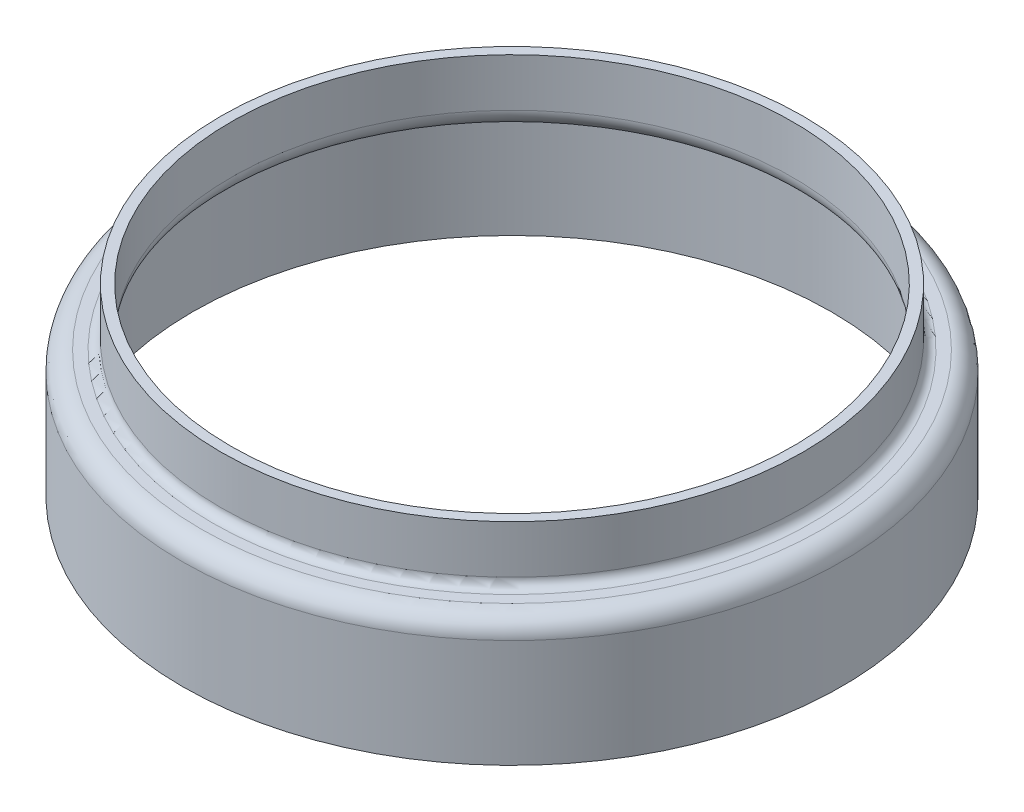
ISO-10303-21;
HEADER;
FILE_DESCRIPTION(('STEP AP214'),'2;1');
FILE_NAME('part.step','',(''),(''),'','','');
FILE_SCHEMA(('AUTOMOTIVE_DESIGN { 1 0 10303 214 1 1 1 1 }'));
ENDSEC;
DATA;
#1=APPLICATION_CONTEXT('core data for automotive mechanical design processes');
#2=APPLICATION_PROTOCOL_DEFINITION('international standard','automotive_design',2000,#1);
#3=PRODUCT_CONTEXT('',#1,'mechanical');
#4=PRODUCT('Part','Part','',(#3));
#5=PRODUCT_RELATED_PRODUCT_CATEGORY('part','',(#4));
#6=PRODUCT_DEFINITION_FORMATION('','',#4);
#7=PRODUCT_DEFINITION_CONTEXT('part definition',#1,'design');
#8=PRODUCT_DEFINITION('design','',#6,#7);
#9=PRODUCT_DEFINITION_SHAPE('','',#8);
#10=(LENGTH_UNIT() NAMED_UNIT(*) SI_UNIT(.MILLI.,.METRE.));
#11=(NAMED_UNIT(*) PLANE_ANGLE_UNIT() SI_UNIT($,.RADIAN.));
#12=(NAMED_UNIT(*) SI_UNIT($,.STERADIAN.) SOLID_ANGLE_UNIT());
#13=UNCERTAINTY_MEASURE_WITH_UNIT(LENGTH_MEASURE(1.E-05),#10,'distance_accuracy_value','');
#14=(GEOMETRIC_REPRESENTATION_CONTEXT(3) GLOBAL_UNCERTAINTY_ASSIGNED_CONTEXT((#13)) GLOBAL_UNIT_ASSIGNED_CONTEXT((#10,
#11,#12)) REPRESENTATION_CONTEXT('',''));
#15=CARTESIAN_POINT('',(0.,0.,0.));
#16=DIRECTION('',(0.,0.,1.));
#17=DIRECTION('',(1.,0.,0.));
#18=AXIS2_PLACEMENT_3D('',#15,#16,#17);
#19=CARTESIAN_POINT('',(0.,71.5790860873113,0.));
#20=DIRECTION('',(0.,1.,0.));
#21=DIRECTION('',(0.,0.,1.));
#22=AXIS2_PLACEMENT_3D('',#19,#20,#21);
#23=CYLINDRICAL_SURFACE('',#22,8.15339999999999);
#24=CARTESIAN_POINT('',(0.,4.57199999999999,0.));
#25=DIRECTION('',(0.,1.,0.));
#26=DIRECTION('',(0.,0.,1.));
#27=AXIS2_PLACEMENT_3D('',#24,#25,#26);
#28=CIRCLE('',#27,8.15339999999999);
#29=CARTESIAN_POINT('',(0.,4.57199999999999,8.15339999999999));
#30=VERTEX_POINT('',#29);
#31=EDGE_CURVE('E249',#30,#30,#28,.T.);
#32=ORIENTED_EDGE('',*,*,#31,.F.);
#33=EDGE_LOOP('',(#32));
#34=FACE_BOUND('',#33,.T.);
#35=CARTESIAN_POINT('',(0.,5.969,0.));
#36=DIRECTION('',(0.,1.,0.));
#37=DIRECTION('',(0.,0.,1.));
#38=AXIS2_PLACEMENT_3D('',#35,#36,#37);
#39=CIRCLE('',#38,8.15339999999999);
#40=CARTESIAN_POINT('',(0.,5.969,8.15339999999999));
#41=VERTEX_POINT('',#40);
#42=EDGE_CURVE('E64',#41,#41,#39,.T.);
#43=ORIENTED_EDGE('',*,*,#42,.T.);
#44=EDGE_LOOP('',(#43));
#45=FACE_BOUND('',#44,.T.);
#46=ADVANCED_FACE('F17',(#34,#45),#23,.F.);
#47=CARTESIAN_POINT('',(0.,4.572,0.));
#48=DIRECTION('',(0.,1.,0.));
#49=DIRECTION('',(0.,0.,1.));
#50=AXIS2_PLACEMENT_3D('',#47,#48,#49);
#51=TOROIDAL_SURFACE('',#50,8.69949999999999,0.5461);
#52=CARTESIAN_POINT('',(0.,4.0259,0.));
#53=DIRECTION('',(0.,-1.,0.));
#54=DIRECTION('',(0.,0.,1.));
#55=AXIS2_PLACEMENT_3D('',#52,#53,#54);
#56=CIRCLE('',#55,8.69949999999999);
#57=CARTESIAN_POINT('',(0.,4.0259,8.69949999999999));
#58=VERTEX_POINT('',#57);
#59=CARTESIAN_POINT('',(0.,4.0259,-8.69949999999999));
#60=VERTEX_POINT('',#59);
#61=EDGE_CURVE('E59',#58,#60,#56,.T.);
#62=ORIENTED_EDGE('',*,*,#61,.T.);
#63=CARTESIAN_POINT('',(0.,4.0259,0.));
#64=DIRECTION('',(0.,-1.,0.));
#65=DIRECTION('',(0.,0.,-1.));
#66=AXIS2_PLACEMENT_3D('',#63,#64,#65);
#67=CIRCLE('',#66,8.69949999999999);
#68=EDGE_CURVE('E56',#60,#58,#67,.T.);
#69=ORIENTED_EDGE('',*,*,#68,.T.);
#70=EDGE_LOOP('',(#62,#69));
#71=FACE_BOUND('',#70,.T.);
#72=ORIENTED_EDGE('',*,*,#31,.T.);
#73=EDGE_LOOP('',(#72));
#74=FACE_BOUND('',#73,.T.);
#75=ADVANCED_FACE('F60',(#71,#74),#51,.T.);
#76=CARTESIAN_POINT('',(0.,5.969,8.44549999999999));
#77=DIRECTION('',(0.,-1.,0.));
#78=DIRECTION('',(0.,0.,-1.));
#79=AXIS2_PLACEMENT_3D('',#76,#77,#78);
#80=PLANE('',#79);
#81=CARTESIAN_POINT('',(0.,5.969,0.));
#82=DIRECTION('',(0.,1.,0.));
#83=DIRECTION('',(0.,0.,1.));
#84=AXIS2_PLACEMENT_3D('',#81,#82,#83);
#85=CIRCLE('',#84,8.44549999999999);
#86=CARTESIAN_POINT('',(0.,5.969,8.44549999999999));
#87=VERTEX_POINT('',#86);
#88=EDGE_CURVE('E69',#87,#87,#85,.F.);
#89=ORIENTED_EDGE('',*,*,#88,.F.);
#90=EDGE_LOOP('',(#89));
#91=FACE_BOUND('',#90,.T.);
#92=ORIENTED_EDGE('',*,*,#42,.F.);
#93=EDGE_LOOP('',(#92));
#94=FACE_BOUND('',#93,.T.);
#95=ADVANCED_FACE('F90',(#91,#94),#80,.F.);
#96=CARTESIAN_POINT('',(0.,4.0259,8.69949999999999));
#97=DIRECTION('',(0.,1.,0.));
#98=DIRECTION('',(0.,0.,1.));
#99=AXIS2_PLACEMENT_3D('',#96,#97,#98);
#100=PLANE('',#99);
#101=ORIENTED_EDGE('',*,*,#61,.F.);
#102=ORIENTED_EDGE('',*,*,#68,.F.);
#103=EDGE_LOOP('',(#101,#102));
#104=FACE_BOUND('',#103,.T.);
#105=CARTESIAN_POINT('',(0.,4.0259,0.));
#106=DIRECTION('',(0.,1.,0.));
#107=DIRECTION('',(0.,0.,-1.));
#108=AXIS2_PLACEMENT_3D('',#105,#106,#107);
#109=CIRCLE('',#108,9.01699999999999);
#110=CARTESIAN_POINT('',(0.,4.0259,9.01699999999999));
#111=VERTEX_POINT('',#110);
#112=CARTESIAN_POINT('',(0.,4.0259,-9.01699999999999));
#113=VERTEX_POINT('',#112);
#114=EDGE_CURVE('E110',#111,#113,#109,.F.);
#115=ORIENTED_EDGE('',*,*,#114,.T.);
#116=CARTESIAN_POINT('',(0.,4.0259,0.));
#117=DIRECTION('',(0.,1.,0.));
#118=DIRECTION('',(0.,0.,1.));
#119=AXIS2_PLACEMENT_3D('',#116,#117,#118);
#120=CIRCLE('',#119,9.01699999999999);
#121=EDGE_CURVE('E109',#113,#111,#120,.F.);
#122=ORIENTED_EDGE('',*,*,#121,.T.);
#123=EDGE_LOOP('',(#115,#122));
#124=FACE_BOUND('',#123,.T.);
#125=ADVANCED_FACE('F67',(#104,#124),#100,.F.);
#126=CARTESIAN_POINT('',(0.,71.5790860873113,0.));
#127=DIRECTION('',(0.,1.,0.));
#128=DIRECTION('',(0.,0.,1.));
#129=AXIS2_PLACEMENT_3D('',#126,#127,#128);
#130=CYLINDRICAL_SURFACE('',#129,8.44549999999999);
#131=CARTESIAN_POINT('',(0.,4.57199999999999,0.));
#132=DIRECTION('',(0.,1.,0.));
#133=DIRECTION('',(0.,0.,1.));
#134=AXIS2_PLACEMENT_3D('',#131,#132,#133);
#135=CIRCLE('',#134,8.44549999999999);
#136=CARTESIAN_POINT('',(0.,4.57199999999999,8.44549999999999));
#137=VERTEX_POINT('',#136);
#138=EDGE_CURVE('E115',#137,#137,#135,.T.);
#139=ORIENTED_EDGE('',*,*,#138,.T.);
#140=EDGE_LOOP('',(#139));
#141=FACE_BOUND('',#140,.T.);
#142=ORIENTED_EDGE('',*,*,#88,.T.);
#143=EDGE_LOOP('',(#142));
#144=FACE_BOUND('',#143,.T.);
#145=ADVANCED_FACE('F89',(#141,#144),#130,.T.);
#146=CARTESIAN_POINT('',(0.,3.7719,0.));
#147=DIRECTION('',(0.,1.,0.));
#148=DIRECTION('',(0.,0.,1.));
#149=AXIS2_PLACEMENT_3D('',#146,#147,#148);
#150=TOROIDAL_SURFACE('',#149,9.01699999999999,0.254);
#151=ORIENTED_EDGE('',*,*,#114,.F.);
#152=ORIENTED_EDGE('',*,*,#121,.F.);
#153=EDGE_LOOP('',(#151,#152));
#154=FACE_BOUND('',#153,.T.);
#155=CARTESIAN_POINT('',(0.,3.77189999999999,0.));
#156=DIRECTION('',(0.,1.,0.));
#157=DIRECTION('',(0.,0.,1.));
#158=AXIS2_PLACEMENT_3D('',#155,#156,#157);
#159=CIRCLE('',#158,9.27099999999999);
#160=CARTESIAN_POINT('',(0.,3.77189999999999,9.27099999999999));
#161=VERTEX_POINT('',#160);
#162=EDGE_CURVE('E117',#161,#161,#159,.F.);
#163=ORIENTED_EDGE('',*,*,#162,.T.);
#164=EDGE_LOOP('',(#163));
#165=FACE_BOUND('',#164,.T.);
#166=ADVANCED_FACE('F113',(#154,#165),#150,.F.);
#167=CARTESIAN_POINT('',(0.,4.572,0.));
#168=DIRECTION('',(0.,1.,0.));
#169=DIRECTION('',(0.,0.,1.));
#170=AXIS2_PLACEMENT_3D('',#167,#168,#169);
#171=TOROIDAL_SURFACE('',#170,8.69949999999999,0.254);
#172=CARTESIAN_POINT('',(0.,4.318,0.));
#173=DIRECTION('',(0.,1.,0.));
#174=DIRECTION('',(0.,0.,-1.));
#175=AXIS2_PLACEMENT_3D('',#172,#173,#174);
#176=CIRCLE('',#175,8.69949999999999);
#177=CARTESIAN_POINT('',(0.,4.318,8.69949999999999));
#178=VERTEX_POINT('',#177);
#179=CARTESIAN_POINT('',(0.,4.318,-8.69949999999999));
#180=VERTEX_POINT('',#179);
#181=EDGE_CURVE('E213',#178,#180,#176,.F.);
#182=ORIENTED_EDGE('',*,*,#181,.F.);
#183=CARTESIAN_POINT('',(0.,4.318,0.));
#184=DIRECTION('',(0.,1.,0.));
#185=DIRECTION('',(0.,0.,1.));
#186=AXIS2_PLACEMENT_3D('',#183,#184,#185);
#187=CIRCLE('',#186,8.69949999999999);
#188=EDGE_CURVE('E122',#180,#178,#187,.F.);
#189=ORIENTED_EDGE('',*,*,#188,.F.);
#190=EDGE_LOOP('',(#182,#189));
#191=FACE_BOUND('',#190,.T.);
#192=ORIENTED_EDGE('',*,*,#138,.F.);
#193=EDGE_LOOP('',(#192));
#194=FACE_BOUND('',#193,.T.);
#195=ADVANCED_FACE('F130',(#191,#194),#171,.F.);
#196=CARTESIAN_POINT('',(0.,71.5790860873113,0.));
#197=DIRECTION('',(0.,1.,0.));
#198=DIRECTION('',(0.,0.,1.));
#199=AXIS2_PLACEMENT_3D('',#196,#197,#198);
#200=CYLINDRICAL_SURFACE('',#199,9.27099999999999);
#201=ORIENTED_EDGE('',*,*,#162,.F.);
#202=EDGE_LOOP('',(#201));
#203=FACE_BOUND('',#202,.T.);
#204=CARTESIAN_POINT('',(0.,0.634999999999997,0.));
#205=DIRECTION('',(0.,1.,0.));
#206=DIRECTION('',(0.,0.,1.));
#207=AXIS2_PLACEMENT_3D('',#204,#205,#206);
#208=CIRCLE('',#207,9.27099999999999);
#209=CARTESIAN_POINT('',(0.,0.634999999999997,9.27099999999999));
#210=VERTEX_POINT('',#209);
#211=EDGE_CURVE('E239',#210,#210,#208,.T.);
#212=ORIENTED_EDGE('',*,*,#211,.F.);
#213=EDGE_LOOP('',(#212));
#214=FACE_BOUND('',#213,.T.);
#215=ADVANCED_FACE('F195',(#203,#214),#200,.F.);
#216=CARTESIAN_POINT('',(0.,4.318,8.69949999999999));
#217=DIRECTION('',(0.,1.,0.));
#218=DIRECTION('',(0.,0.,1.));
#219=AXIS2_PLACEMENT_3D('',#216,#217,#218);
#220=PLANE('',#219);
#221=ORIENTED_EDGE('',*,*,#188,.T.);
#222=ORIENTED_EDGE('',*,*,#181,.T.);
#223=EDGE_LOOP('',(#221,#222));
#224=FACE_BOUND('',#223,.T.);
#225=CARTESIAN_POINT('',(0.,4.318,0.));
#226=DIRECTION('',(0.,-1.,0.));
#227=DIRECTION('',(0.,0.,-1.));
#228=AXIS2_PLACEMENT_3D('',#225,#226,#227);
#229=CIRCLE('',#228,9.01699999999999);
#230=CARTESIAN_POINT('',(0.,4.318,-9.01699999999999));
#231=VERTEX_POINT('',#230);
#232=CARTESIAN_POINT('',(0.,4.318,9.01699999999999));
#233=VERTEX_POINT('',#232);
#234=EDGE_CURVE('E183',#231,#233,#229,.T.);
#235=ORIENTED_EDGE('',*,*,#234,.F.);
#236=CARTESIAN_POINT('',(0.,4.318,0.));
#237=DIRECTION('',(0.,-1.,0.));
#238=DIRECTION('',(0.,0.,1.));
#239=AXIS2_PLACEMENT_3D('',#236,#237,#238);
#240=CIRCLE('',#239,9.01699999999999);
#241=EDGE_CURVE('E35',#233,#231,#240,.T.);
#242=ORIENTED_EDGE('',*,*,#241,.F.);
#243=EDGE_LOOP('',(#235,#242));
#244=FACE_BOUND('',#243,.T.);
#245=ADVANCED_FACE('F187',(#224,#244),#220,.T.);
#246=CARTESIAN_POINT('',(0.,0.634999999999997,-9.652));
#247=DIRECTION('',(0.,-1.,0.));
#248=DIRECTION('',(0.,0.,-1.));
#249=AXIS2_PLACEMENT_3D('',#246,#247,#248);
#250=PLANE('',#249);
#251=ORIENTED_EDGE('',*,*,#211,.T.);
#252=EDGE_LOOP('',(#251));
#253=FACE_BOUND('',#252,.T.);
#254=CARTESIAN_POINT('',(0.,0.634999999999997,0.));
#255=DIRECTION('',(0.,1.,0.));
#256=DIRECTION('',(0.,0.,1.));
#257=AXIS2_PLACEMENT_3D('',#254,#255,#256);
#258=CIRCLE('',#257,9.56309999999999);
#259=CARTESIAN_POINT('',(0.,0.634999999999997,9.56309999999999));
#260=VERTEX_POINT('',#259);
#261=EDGE_CURVE('E27',#260,#260,#258,.T.);
#262=ORIENTED_EDGE('',*,*,#261,.F.);
#263=EDGE_LOOP('',(#262));
#264=FACE_BOUND('',#263,.T.);
#265=ADVANCED_FACE('F175',(#253,#264),#250,.T.);
#266=CARTESIAN_POINT('',(0.,3.7719,0.));
#267=DIRECTION('',(0.,1.,0.));
#268=DIRECTION('',(0.,0.,1.));
#269=AXIS2_PLACEMENT_3D('',#266,#267,#268);
#270=TOROIDAL_SURFACE('',#269,9.01699999999999,0.5461);
#271=ORIENTED_EDGE('',*,*,#241,.T.);
#272=ORIENTED_EDGE('',*,*,#234,.T.);
#273=EDGE_LOOP('',(#271,#272));
#274=FACE_BOUND('',#273,.T.);
#275=CARTESIAN_POINT('',(0.,3.77189999999999,0.));
#276=DIRECTION('',(0.,1.,0.));
#277=DIRECTION('',(0.,0.,1.));
#278=AXIS2_PLACEMENT_3D('',#275,#276,#277);
#279=CIRCLE('',#278,9.56309999999999);
#280=CARTESIAN_POINT('',(0.,3.77189999999999,9.56309999999999));
#281=VERTEX_POINT('',#280);
#282=EDGE_CURVE('E11',#281,#281,#279,.F.);
#283=ORIENTED_EDGE('',*,*,#282,.F.);
#284=EDGE_LOOP('',(#283));
#285=FACE_BOUND('',#284,.T.);
#286=ADVANCED_FACE('F163',(#274,#285),#270,.T.);
#287=CARTESIAN_POINT('',(0.,71.5790860873113,0.));
#288=DIRECTION('',(0.,1.,0.));
#289=DIRECTION('',(0.,0.,1.));
#290=AXIS2_PLACEMENT_3D('',#287,#288,#289);
#291=CYLINDRICAL_SURFACE('',#290,9.56309999999999);
#292=ORIENTED_EDGE('',*,*,#282,.T.);
#293=EDGE_LOOP('',(#292));
#294=FACE_BOUND('',#293,.T.);
#295=ORIENTED_EDGE('',*,*,#261,.T.);
#296=EDGE_LOOP('',(#295));
#297=FACE_BOUND('',#296,.T.);
#298=ADVANCED_FACE('F174',(#294,#297),#291,.T.);
#299=CLOSED_SHELL('',(#46,#75,#95,#125,#145,#166,#195,#215,#245,#265,#286,#298));
#300=MANIFOLD_SOLID_BREP('B1',#299);
#301=ADVANCED_BREP_SHAPE_REPRESENTATION('',(#18,#300),#14);
#302=SHAPE_DEFINITION_REPRESENTATION(#9,#301);
ENDSEC;
END-ISO-10303-21;
